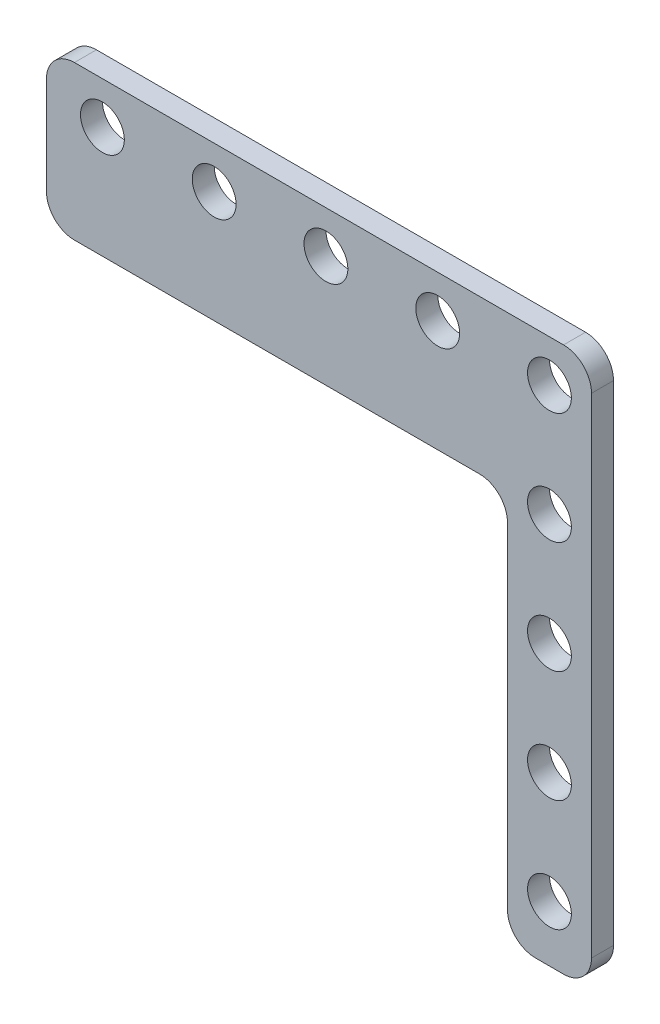
ISO-10303-21;
HEADER;
FILE_DESCRIPTION(('STEP AP214'),'2;1');
FILE_NAME('part.step','',(''),(''),'','','');
FILE_SCHEMA(('AUTOMOTIVE_DESIGN { 1 0 10303 214 1 1 1 1 }'));
ENDSEC;
DATA;
#1=APPLICATION_CONTEXT('core data for automotive mechanical design processes');
#2=APPLICATION_PROTOCOL_DEFINITION('international standard','automotive_design',2000,#1);
#3=PRODUCT_CONTEXT('',#1,'mechanical');
#4=PRODUCT('Part','Part','',(#3));
#5=PRODUCT_RELATED_PRODUCT_CATEGORY('part','',(#4));
#6=PRODUCT_DEFINITION_FORMATION('','',#4);
#7=PRODUCT_DEFINITION_CONTEXT('part definition',#1,'design');
#8=PRODUCT_DEFINITION('design','',#6,#7);
#9=PRODUCT_DEFINITION_SHAPE('','',#8);
#10=(LENGTH_UNIT() NAMED_UNIT(*) SI_UNIT(.MILLI.,.METRE.));
#11=(NAMED_UNIT(*) PLANE_ANGLE_UNIT() SI_UNIT($,.RADIAN.));
#12=(NAMED_UNIT(*) SI_UNIT($,.STERADIAN.) SOLID_ANGLE_UNIT());
#13=UNCERTAINTY_MEASURE_WITH_UNIT(LENGTH_MEASURE(1.E-05),#10,'distance_accuracy_value','');
#14=(GEOMETRIC_REPRESENTATION_CONTEXT(3) GLOBAL_UNCERTAINTY_ASSIGNED_CONTEXT((#13)) GLOBAL_UNIT_ASSIGNED_CONTEXT((#10,
#11,#12)) REPRESENTATION_CONTEXT('',''));
#15=CARTESIAN_POINT('',(0.,0.,0.));
#16=DIRECTION('',(0.,0.,1.));
#17=DIRECTION('',(1.,0.,0.));
#18=AXIS2_PLACEMENT_3D('',#15,#16,#17);
#19=CARTESIAN_POINT('',(17.4752000000032,906.475199999967,1.53492743580445E-13));
#20=DIRECTION('',(0.,1.,0.));
#21=DIRECTION('',(1.,0.,0.));
#22=AXIS2_PLACEMENT_3D('',#19,#20,#21);
#23=PLANE('',#22);
#24=DIRECTION('',(0.,0.,-1.));
#25=VECTOR('',#24,1.);
#26=CARTESIAN_POINT('',(-41.2749999999967,906.475199999967,1.5349987714556E-13));
#27=LINE('',#26,#25);
#28=CARTESIAN_POINT('',(-41.2749999999967,906.475199999967,2.50000000000015));
#29=VERTEX_POINT('',#28);
#30=CARTESIAN_POINT('',(-41.2749999999967,906.475199999967,1.53506279213021E-13));
#31=VERTEX_POINT('',#30);
#32=EDGE_CURVE('E261',#29,#31,#27,.T.);
#33=ORIENTED_EDGE('',*,*,#32,.F.);
#34=DIRECTION('',(-1.,0.,0.));
#35=VECTOR('',#34,1.);
#36=CARTESIAN_POINT('',(17.4752000000032,906.475199999967,2.50000000000015));
#37=LINE('',#36,#35);
#38=CARTESIAN_POINT('',(14.3002000000032,906.475199999967,2.50000000000015));
#39=VERTEX_POINT('',#38);
#40=EDGE_CURVE('E395',#39,#29,#37,.T.);
#41=ORIENTED_EDGE('',*,*,#40,.F.);
#42=DIRECTION('',(0.,0.,1.));
#43=VECTOR('',#42,1.);
#44=CARTESIAN_POINT('',(14.3002000000032,906.475199999967,1.53103754470967E-13));
#45=LINE('',#44,#43);
#46=CARTESIAN_POINT('',(14.3002000000032,906.475199999967,1.53493475078099E-13));
#47=VERTEX_POINT('',#46);
#48=EDGE_CURVE('E11',#47,#39,#45,.T.);
#49=ORIENTED_EDGE('',*,*,#48,.F.);
#50=DIRECTION('',(-1.,0.,0.));
#51=VECTOR('',#50,1.);
#52=CARTESIAN_POINT('',(17.4752000000032,906.475199999967,1.53492743580445E-13));
#53=LINE('',#52,#51);
#54=EDGE_CURVE('E243',#47,#31,#53,.T.);
#55=ORIENTED_EDGE('',*,*,#54,.T.);
#56=EDGE_LOOP('',(#33,#41,#49,#55));
#57=FACE_BOUND('',#56,.T.);
#58=ADVANCED_FACE('F17',(#57),#23,.T.);
#59=CARTESIAN_POINT('',(17.4752000000032,844.549999999967,1.52714765361489E-13));
#60=DIRECTION('',(1.,0.,0.));
#61=DIRECTION('',(0.,1.,0.));
#62=AXIS2_PLACEMENT_3D('',#59,#60,#61);
#63=PLANE('',#62);
#64=DIRECTION('',(0.,0.,1.));
#65=VECTOR('',#64,1.);
#66=CARTESIAN_POINT('',(17.4752000000032,847.724999999967,1.52716778443031E-13));
#67=LINE('',#66,#65);
#68=CARTESIAN_POINT('',(17.4752000000032,847.724999999967,1.52754653498228E-13));
#69=VERTEX_POINT('',#68);
#70=CARTESIAN_POINT('',(17.4752000000032,847.724999999967,2.50000000000015));
#71=VERTEX_POINT('',#70);
#72=EDGE_CURVE('E264',#69,#71,#67,.T.);
#73=ORIENTED_EDGE('',*,*,#72,.F.);
#74=DIRECTION('',(0.,1.,0.));
#75=VECTOR('',#74,1.);
#76=CARTESIAN_POINT('',(17.4752000000032,844.549999999967,1.52714765361489E-13));
#77=LINE('',#76,#75);
#78=CARTESIAN_POINT('',(17.4752000000032,903.300199999967,1.53452855443706E-13));
#79=VERTEX_POINT('',#78);
#80=EDGE_CURVE('E354',#69,#79,#77,.T.);
#81=ORIENTED_EDGE('',*,*,#80,.T.);
#82=DIRECTION('',(0.,0.,-1.));
#83=VECTOR('',#82,1.);
#84=CARTESIAN_POINT('',(17.4752000000032,903.300199999967,1.53103754470967E-13));
#85=LINE('',#84,#83);
#86=CARTESIAN_POINT('',(17.4752000000032,903.300199999967,2.50000000000015));
#87=VERTEX_POINT('',#86);
#88=EDGE_CURVE('E26',#87,#79,#85,.T.);
#89=ORIENTED_EDGE('',*,*,#88,.F.);
#90=DIRECTION('',(0.,1.,0.));
#91=VECTOR('',#90,1.);
#92=CARTESIAN_POINT('',(17.4752000000032,844.549999999967,2.50000000000015));
#93=LINE('',#92,#91);
#94=EDGE_CURVE('E387',#71,#87,#93,.T.);
#95=ORIENTED_EDGE('',*,*,#94,.F.);
#96=EDGE_LOOP('',(#73,#81,#89,#95));
#97=FACE_BOUND('',#96,.T.);
#98=ADVANCED_FACE('F469',(#97),#63,.T.);
#99=CARTESIAN_POINT('',(14.3002000000032,903.300199999967,1.53103754470967E-13));
#100=DIRECTION('',(0.,0.,1.));
#101=DIRECTION('',(0.707106781186552,0.707106781186543,0.));
#102=AXIS2_PLACEMENT_3D('',#99,#100,#101);
#103=CYLINDRICAL_SURFACE('',#102,3.175);
#104=CARTESIAN_POINT('',(14.3002000000032,903.300199999967,2.50000000000015));
#105=DIRECTION('',(0.,0.,-1.));
#106=DIRECTION('',(0.707106781186552,0.707106781186543,0.));
#107=AXIS2_PLACEMENT_3D('',#104,#105,#106);
#108=CIRCLE('',#107,3.175);
#109=EDGE_CURVE('E391',#39,#87,#108,.T.);
#110=ORIENTED_EDGE('',*,*,#109,.T.);
#111=ORIENTED_EDGE('',*,*,#88,.T.);
#112=CARTESIAN_POINT('',(14.3002000000032,903.300199999967,1.53110888036082E-13));
#113=DIRECTION('',(0.,0.,1.));
#114=DIRECTION('',(0.707106781186552,0.707106781186543,0.));
#115=AXIS2_PLACEMENT_3D('',#112,#113,#114);
#116=CIRCLE('',#115,3.175);
#117=EDGE_CURVE('E247',#79,#47,#116,.T.);
#118=ORIENTED_EDGE('',*,*,#117,.T.);
#119=ORIENTED_EDGE('',*,*,#48,.T.);
#120=EDGE_LOOP('',(#110,#111,#118,#119));
#121=FACE_BOUND('',#120,.T.);
#122=ADVANCED_FACE('F474',(#121),#103,.T.);
#123=CARTESIAN_POINT('',(-41.2749999999967,903.300199999967,1.5349987714556E-13));
#124=DIRECTION('',(0.,0.,1.));
#125=DIRECTION('',(-0.707106781186552,0.707106781186543,0.));
#126=AXIS2_PLACEMENT_3D('',#123,#124,#125);
#127=CYLINDRICAL_SURFACE('',#126,3.175);
#128=CARTESIAN_POINT('',(-41.2749999999967,903.300199999967,2.50000000000015));
#129=DIRECTION('',(0.,0.,-1.));
#130=DIRECTION('',(-0.707106781186552,0.707106781186543,0.));
#131=AXIS2_PLACEMENT_3D('',#128,#129,#130);
#132=CIRCLE('',#131,3.175);
#133=CARTESIAN_POINT('',(-44.4499999999967,903.300199999967,2.50000000000015));
#134=VERTEX_POINT('',#133);
#135=EDGE_CURVE('E399',#134,#29,#132,.T.);
#136=ORIENTED_EDGE('',*,*,#135,.T.);
#137=ORIENTED_EDGE('',*,*,#32,.T.);
#138=CARTESIAN_POINT('',(-41.2749999999967,903.300199999967,1.53110888036082E-13));
#139=DIRECTION('',(0.,0.,1.));
#140=DIRECTION('',(-0.707106781186552,0.707106781186543,0.));
#141=AXIS2_PLACEMENT_3D('',#138,#139,#140);
#142=CIRCLE('',#141,3.175);
#143=CARTESIAN_POINT('',(-44.4499999999967,903.300199999967,1.53467122573935E-13));
#144=VERTEX_POINT('',#143);
#145=EDGE_CURVE('E248',#31,#144,#142,.T.);
#146=ORIENTED_EDGE('',*,*,#145,.T.);
#147=DIRECTION('',(0.,0.,1.));
#148=VECTOR('',#147,1.);
#149=CARTESIAN_POINT('',(-44.4499999999967,903.300199999967,1.5349987714556E-13));
#150=LINE('',#149,#148);
#151=EDGE_CURVE('E20',#144,#134,#150,.T.);
#152=ORIENTED_EDGE('',*,*,#151,.T.);
#153=EDGE_LOOP('',(#136,#137,#146,#152));
#154=FACE_BOUND('',#153,.T.);
#155=ADVANCED_FACE('F479',(#154),#127,.T.);
#156=CARTESIAN_POINT('',(-44.4499999999967,906.475199999967,1.53507010710674E-13));
#157=DIRECTION('',(-1.,0.,0.));
#158=DIRECTION('',(0.,0.,1.));
#159=AXIS2_PLACEMENT_3D('',#156,#157,#158);
#160=PLANE('',#159);
#161=DIRECTION('',(0.,0.,-1.));
#162=VECTOR('',#161,1.);
#163=CARTESIAN_POINT('',(-44.4499999999967,892.174999999967,1.53397238558369E-13));
#164=LINE('',#163,#162);
#165=CARTESIAN_POINT('',(-44.4499999999967,892.174999999967,2.50000000000015));
#166=VERTEX_POINT('',#165);
#167=CARTESIAN_POINT('',(-44.4499999999967,892.174999999967,1.53327354542802E-13));
#168=VERTEX_POINT('',#167);
#169=EDGE_CURVE('E39',#166,#168,#164,.T.);
#170=ORIENTED_EDGE('',*,*,#169,.F.);
#171=DIRECTION('',(0.,-1.,0.));
#172=VECTOR('',#171,1.);
#173=CARTESIAN_POINT('',(-44.4499999999967,906.475199999967,2.50000000000015));
#174=LINE('',#173,#172);
#175=EDGE_CURVE('E402',#134,#166,#174,.T.);
#176=ORIENTED_EDGE('',*,*,#175,.F.);
#177=ORIENTED_EDGE('',*,*,#151,.F.);
#178=DIRECTION('',(0.,-1.,0.));
#179=VECTOR('',#178,1.);
#180=CARTESIAN_POINT('',(-44.4499999999967,906.475199999967,1.53507010710674E-13));
#181=LINE('',#180,#179);
#182=EDGE_CURVE('E294',#144,#168,#181,.T.);
#183=ORIENTED_EDGE('',*,*,#182,.T.);
#184=EDGE_LOOP('',(#170,#176,#177,#183));
#185=FACE_BOUND('',#184,.T.);
#186=ADVANCED_FACE('F480',(#185),#160,.T.);
#187=CARTESIAN_POINT('',(-41.2749999999967,892.174999999967,1.53397238558369E-13));
#188=DIRECTION('',(0.,0.,1.));
#189=DIRECTION('',(-0.707106781186552,-0.707106781186543,0.));
#190=AXIS2_PLACEMENT_3D('',#187,#188,#189);
#191=CYLINDRICAL_SURFACE('',#190,3.175);
#192=CARTESIAN_POINT('',(-41.2749999999967,892.174999999967,2.50000000000015));
#193=DIRECTION('',(0.,0.,-1.));
#194=DIRECTION('',(-0.707106781186552,-0.707106781186543,0.));
#195=AXIS2_PLACEMENT_3D('',#192,#193,#194);
#196=CIRCLE('',#195,3.175);
#197=CARTESIAN_POINT('',(-41.2749999999967,888.999999999967,2.50000000000015));
#198=VERTEX_POINT('',#197);
#199=EDGE_CURVE('E405',#198,#166,#196,.T.);
#200=ORIENTED_EDGE('',*,*,#199,.T.);
#201=ORIENTED_EDGE('',*,*,#169,.T.);
#202=CARTESIAN_POINT('',(-41.2749999999967,892.174999999967,1.53110888036082E-13));
#203=DIRECTION('',(0.,0.,1.));
#204=DIRECTION('',(-0.707106781186552,-0.707106781186543,0.));
#205=AXIS2_PLACEMENT_3D('',#202,#203,#204);
#206=CIRCLE('',#205,3.175);
#207=CARTESIAN_POINT('',(-41.2749999999967,888.999999999967,1.5328673490841E-13));
#208=VERTEX_POINT('',#207);
#209=EDGE_CURVE('E290',#168,#208,#206,.T.);
#210=ORIENTED_EDGE('',*,*,#209,.T.);
#211=DIRECTION('',(0.,0.,1.));
#212=VECTOR('',#211,1.);
#213=CARTESIAN_POINT('',(-41.2749999999967,888.999999999967,1.53397238558369E-13));
#214=LINE('',#213,#212);
#215=EDGE_CURVE('E373',#208,#198,#214,.T.);
#216=ORIENTED_EDGE('',*,*,#215,.T.);
#217=EDGE_LOOP('',(#200,#201,#210,#216));
#218=FACE_BOUND('',#217,.T.);
#219=ADVANCED_FACE('F487',(#218),#191,.T.);
#220=CARTESIAN_POINT('',(14.3002000000032,847.724999999967,1.52716778443031E-13));
#221=DIRECTION('',(0.,0.,1.));
#222=DIRECTION('',(0.707106781186552,-0.707106781186543,0.));
#223=AXIS2_PLACEMENT_3D('',#220,#221,#222);
#224=CYLINDRICAL_SURFACE('',#223,3.175);
#225=CARTESIAN_POINT('',(14.3002000000032,847.724999999967,2.50000000000015));
#226=DIRECTION('',(0.,0.,-1.));
#227=DIRECTION('',(0.707106781186552,-0.707106781186543,0.));
#228=AXIS2_PLACEMENT_3D('',#225,#226,#227);
#229=CIRCLE('',#228,3.175);
#230=CARTESIAN_POINT('',(14.3002000000032,844.549999999967,2.50000000000015));
#231=VERTEX_POINT('',#230);
#232=EDGE_CURVE('E383',#71,#231,#229,.T.);
#233=ORIENTED_EDGE('',*,*,#232,.T.);
#234=DIRECTION('',(0.,0.,-1.));
#235=VECTOR('',#234,1.);
#236=CARTESIAN_POINT('',(14.3002000000032,844.549999999967,1.52716778443031E-13));
#237=LINE('',#236,#235);
#238=CARTESIAN_POINT('',(14.3002000000032,844.549999999967,1.52715496859142E-13));
#239=VERTEX_POINT('',#238);
#240=EDGE_CURVE('E349',#231,#239,#237,.T.);
#241=ORIENTED_EDGE('',*,*,#240,.T.);
#242=CARTESIAN_POINT('',(14.3002000000032,847.724999999967,1.53110888036082E-13));
#243=DIRECTION('',(0.,0.,1.));
#244=DIRECTION('',(0.707106781186552,-0.707106781186543,0.));
#245=AXIS2_PLACEMENT_3D('',#242,#243,#244);
#246=CIRCLE('',#245,3.175);
#247=EDGE_CURVE('E358',#239,#69,#246,.T.);
#248=ORIENTED_EDGE('',*,*,#247,.T.);
#249=ORIENTED_EDGE('',*,*,#72,.T.);
#250=EDGE_LOOP('',(#233,#241,#248,#249));
#251=FACE_BOUND('',#250,.T.);
#252=ADVANCED_FACE('F465',(#251),#224,.T.);
#253=CARTESIAN_POINT('',(3.0975222387042E-12,844.549999999967,1.52718791524573E-13));
#254=DIRECTION('',(0.,-1.,0.));
#255=DIRECTION('',(0.,0.,-1.));
#256=AXIS2_PLACEMENT_3D('',#253,#254,#255);
#257=PLANE('',#256);
#258=DIRECTION('',(0.,0.,1.));
#259=VECTOR('',#258,1.);
#260=CARTESIAN_POINT('',(11.0998000000031,844.549999999967,1.25000000000015));
#261=LINE('',#260,#259);
#262=CARTESIAN_POINT('',(11.0998000000031,844.549999999967,1.52716234208777E-13));
#263=VERTEX_POINT('',#262);
#264=CARTESIAN_POINT('',(11.0998000000031,844.549999999967,2.50000000000015));
#265=VERTEX_POINT('',#264);
#266=EDGE_CURVE('E324',#263,#265,#261,.T.);
#267=ORIENTED_EDGE('',*,*,#266,.F.);
#268=DIRECTION('',(1.,0.,0.));
#269=VECTOR('',#268,1.);
#270=CARTESIAN_POINT('',(3.0975222387042E-12,844.549999999967,1.52718791524573E-13));
#271=LINE('',#270,#269);
#272=EDGE_CURVE('E365',#263,#239,#271,.T.);
#273=ORIENTED_EDGE('',*,*,#272,.T.);
#274=ORIENTED_EDGE('',*,*,#240,.F.);
#275=DIRECTION('',(1.,0.,0.));
#276=VECTOR('',#275,1.);
#277=CARTESIAN_POINT('',(3.0975222387042E-12,844.549999999967,2.50000000000015));
#278=LINE('',#277,#276);
#279=EDGE_CURVE('E377',#265,#231,#278,.T.);
#280=ORIENTED_EDGE('',*,*,#279,.F.);
#281=EDGE_LOOP('',(#267,#273,#274,#280));
#282=FACE_BOUND('',#281,.T.);
#283=ADVANCED_FACE('F463',(#282),#257,.T.);
#284=CARTESIAN_POINT('',(-13.4873999999968,875.512599999967,2.50000000000015));
#285=DIRECTION('',(0.,0.,1.));
#286=DIRECTION('',(1.,0.,0.));
#287=AXIS2_PLACEMENT_3D('',#284,#285,#286);
#288=PLANE('',#287);
#289=CARTESIAN_POINT('',(-38.0999999999977,901.699999999967,2.50000000000015));
#290=DIRECTION('',(0.,0.,-1.));
#291=DIRECTION('',(1.,0.,0.));
#292=AXIS2_PLACEMENT_3D('',#289,#290,#291);
#293=CIRCLE('',#292,2.4892);
#294=CARTESIAN_POINT('',(-40.5891999999977,901.699999999967,2.50000000000015));
#295=VERTEX_POINT('',#294);
#296=EDGE_CURVE('E312',#295,#295,#293,.T.);
#297=ORIENTED_EDGE('',*,*,#296,.T.);
#298=EDGE_LOOP('',(#297));
#299=FACE_BOUND('',#298,.T.);
#300=CARTESIAN_POINT('',(12.7000000000032,901.699999999967,2.50000000000015));
#301=DIRECTION('',(0.,0.,-1.));
#302=DIRECTION('',(1.,0.,0.));
#303=AXIS2_PLACEMENT_3D('',#300,#301,#302);
#304=CIRCLE('',#303,2.4892);
#305=CARTESIAN_POINT('',(10.2108000000032,901.699999999967,2.50000000000015));
#306=VERTEX_POINT('',#305);
#307=EDGE_CURVE('E301',#306,#306,#304,.T.);
#308=ORIENTED_EDGE('',*,*,#307,.T.);
#309=EDGE_LOOP('',(#308));
#310=FACE_BOUND('',#309,.T.);
#311=CARTESIAN_POINT('',(12.700000000003,850.89999999997,2.50000000000015));
#312=DIRECTION('',(0.,0.,-1.));
#313=DIRECTION('',(1.,0.,0.));
#314=AXIS2_PLACEMENT_3D('',#311,#312,#313);
#315=CIRCLE('',#314,2.4892);
#316=CARTESIAN_POINT('',(10.210800000003,850.89999999997,2.50000000000015));
#317=VERTEX_POINT('',#316);
#318=EDGE_CURVE('E270',#317,#317,#315,.T.);
#319=ORIENTED_EDGE('',*,*,#318,.T.);
#320=EDGE_LOOP('',(#319));
#321=FACE_BOUND('',#320,.T.);
#322=CARTESIAN_POINT('',(12.7000000000032,888.999999999967,2.50000000000015));
#323=DIRECTION('',(0.,0.,-1.));
#324=DIRECTION('',(1.,0.,0.));
#325=AXIS2_PLACEMENT_3D('',#322,#323,#324);
#326=CIRCLE('',#325,2.4892);
#327=CARTESIAN_POINT('',(10.2108000000032,888.999999999967,2.50000000000015));
#328=VERTEX_POINT('',#327);
#329=EDGE_CURVE('E276',#328,#328,#326,.T.);
#330=ORIENTED_EDGE('',*,*,#329,.T.);
#331=EDGE_LOOP('',(#330));
#332=FACE_BOUND('',#331,.T.);
#333=CARTESIAN_POINT('',(-25.3999999999976,901.699999999967,2.50000000000015));
#334=DIRECTION('',(0.,0.,-1.));
#335=DIRECTION('',(1.,0.,0.));
#336=AXIS2_PLACEMENT_3D('',#333,#334,#335);
#337=CIRCLE('',#336,2.4892);
#338=CARTESIAN_POINT('',(-27.8891999999977,901.699999999967,2.50000000000015));
#339=VERTEX_POINT('',#338);
#340=EDGE_CURVE('E214',#339,#339,#337,.T.);
#341=ORIENTED_EDGE('',*,*,#340,.T.);
#342=EDGE_LOOP('',(#341));
#343=FACE_BOUND('',#342,.T.);
#344=CARTESIAN_POINT('',(3.29514193708748E-12,901.699999999967,2.50000000000015));
#345=DIRECTION('',(0.,0.,-1.));
#346=DIRECTION('',(1.,0.,0.));
#347=AXIS2_PLACEMENT_3D('',#344,#345,#346);
#348=CIRCLE('',#347,2.4892);
#349=CARTESIAN_POINT('',(-2.4891999999967,901.699999999967,2.50000000000015));
#350=VERTEX_POINT('',#349);
#351=EDGE_CURVE('E225',#350,#350,#348,.T.);
#352=ORIENTED_EDGE('',*,*,#351,.T.);
#353=EDGE_LOOP('',(#352));
#354=FACE_BOUND('',#353,.T.);
#355=CARTESIAN_POINT('',(12.7000000000031,863.59999999997,2.50000000000015));
#356=DIRECTION('',(0.,0.,-1.));
#357=DIRECTION('',(1.,0.,0.));
#358=AXIS2_PLACEMENT_3D('',#355,#356,#357);
#359=CIRCLE('',#358,2.4892);
#360=CARTESIAN_POINT('',(10.2108000000031,863.59999999997,2.50000000000015));
#361=VERTEX_POINT('',#360);
#362=EDGE_CURVE('E234',#361,#361,#359,.T.);
#363=ORIENTED_EDGE('',*,*,#362,.T.);
#364=EDGE_LOOP('',(#363));
#365=FACE_BOUND('',#364,.T.);
#366=CARTESIAN_POINT('',(12.7000000000031,876.299999999969,2.50000000000015));
#367=DIRECTION('',(0.,0.,-1.));
#368=DIRECTION('',(1.,0.,0.));
#369=AXIS2_PLACEMENT_3D('',#366,#367,#368);
#370=CIRCLE('',#369,2.4892);
#371=CARTESIAN_POINT('',(10.2108000000031,876.299999999969,2.50000000000015));
#372=VERTEX_POINT('',#371);
#373=EDGE_CURVE('E238',#372,#372,#370,.T.);
#374=ORIENTED_EDGE('',*,*,#373,.T.);
#375=EDGE_LOOP('',(#374));
#376=FACE_BOUND('',#375,.T.);
#377=CARTESIAN_POINT('',(-12.699999999997,901.699999999967,2.50000000000015));
#378=DIRECTION('',(0.,0.,-1.));
#379=DIRECTION('',(1.,0.,0.));
#380=AXIS2_PLACEMENT_3D('',#377,#378,#379);
#381=CIRCLE('',#380,2.4892);
#382=CARTESIAN_POINT('',(-15.189199999997,901.699999999967,2.50000000000015));
#383=VERTEX_POINT('',#382);
#384=EDGE_CURVE('E420',#383,#383,#381,.T.);
#385=ORIENTED_EDGE('',*,*,#384,.T.);
#386=EDGE_LOOP('',(#385));
#387=FACE_BOUND('',#386,.T.);
#388=CARTESIAN_POINT('',(11.0998000000031,847.724999999967,2.50000000000015));
#389=DIRECTION('',(0.,0.,-1.));
#390=DIRECTION('',(-0.707106781186552,-0.707106781186543,0.));
#391=AXIS2_PLACEMENT_3D('',#388,#389,#390);
#392=CIRCLE('',#391,3.175);
#393=CARTESIAN_POINT('',(7.92480000000315,847.724999999967,2.50000000000015));
#394=VERTEX_POINT('',#393);
#395=EDGE_CURVE('E328',#265,#394,#392,.T.);
#396=ORIENTED_EDGE('',*,*,#395,.F.);
#397=ORIENTED_EDGE('',*,*,#279,.T.);
#398=ORIENTED_EDGE('',*,*,#232,.F.);
#399=ORIENTED_EDGE('',*,*,#94,.T.);
#400=ORIENTED_EDGE('',*,*,#109,.F.);
#401=ORIENTED_EDGE('',*,*,#40,.T.);
#402=ORIENTED_EDGE('',*,*,#135,.F.);
#403=ORIENTED_EDGE('',*,*,#175,.T.);
#404=ORIENTED_EDGE('',*,*,#199,.F.);
#405=DIRECTION('',(1.,0.,0.));
#406=VECTOR('',#405,1.);
#407=CARTESIAN_POINT('',(-6.74369999999683,888.999999999967,2.50000000000015));
#408=LINE('',#407,#406);
#409=CARTESIAN_POINT('',(4.74980000000315,888.999999999967,2.50000000000015));
#410=VERTEX_POINT('',#409);
#411=EDGE_CURVE('E281',#198,#410,#408,.T.);
#412=ORIENTED_EDGE('',*,*,#411,.T.);
#413=CARTESIAN_POINT('',(4.74980000000315,885.824999999967,2.50000000000015));
#414=DIRECTION('',(0.,0.,1.));
#415=DIRECTION('',(0.707106781186554,0.707106781186542,0.));
#416=AXIS2_PLACEMENT_3D('',#413,#414,#415);
#417=CIRCLE('',#416,3.175);
#418=CARTESIAN_POINT('',(7.92480000000315,885.824999999967,2.50000000000015));
#419=VERTEX_POINT('',#418);
#420=EDGE_CURVE('E282',#419,#410,#417,.T.);
#421=ORIENTED_EDGE('',*,*,#420,.F.);
#422=DIRECTION('',(0.,-1.,0.));
#423=VECTOR('',#422,1.);
#424=CARTESIAN_POINT('',(7.92480000000315,882.256299999967,2.50000000000015));
#425=LINE('',#424,#423);
#426=EDGE_CURVE('E366',#419,#394,#425,.T.);
#427=ORIENTED_EDGE('',*,*,#426,.T.);
#428=EDGE_LOOP('',(#396,#397,#398,#399,#400,#401,#402,#403,#404,#412,#421,#427));
#429=FACE_BOUND('',#428,.T.);
#430=ADVANCED_FACE('F435',(#299,#310,#321,#332,#343,#354,#365,#376,#387,#429),#288,.T.);
#431=CARTESIAN_POINT('',(-44.4499999999967,888.999999999967,1.53287466406063E-13));
#432=DIRECTION('',(0.,-1.,0.));
#433=DIRECTION('',(-1.,0.,0.));
#434=AXIS2_PLACEMENT_3D('',#431,#432,#433);
#435=PLANE('',#434);
#436=DIRECTION('',(0.,0.,-1.));
#437=VECTOR('',#436,1.);
#438=CARTESIAN_POINT('',(4.74980000000315,888.999999999967,1.25000000000015));
#439=LINE('',#438,#437);
#440=CARTESIAN_POINT('',(4.74980000000315,888.999999999967,1.53208129376766E-13));
#441=VERTEX_POINT('',#440);
#442=EDGE_CURVE('E278',#410,#441,#439,.T.);
#443=ORIENTED_EDGE('',*,*,#442,.F.);
#444=ORIENTED_EDGE('',*,*,#411,.F.);
#445=ORIENTED_EDGE('',*,*,#215,.F.);
#446=DIRECTION('',(-1.,0.,0.));
#447=VECTOR('',#446,1.);
#448=CARTESIAN_POINT('',(-6.74369999999683,888.999999999967,1.53210777398272E-13));
#449=LINE('',#448,#447);
#450=EDGE_CURVE('E295',#441,#208,#449,.T.);
#451=ORIENTED_EDGE('',*,*,#450,.F.);
#452=EDGE_LOOP('',(#443,#444,#445,#451));
#453=FACE_BOUND('',#452,.T.);
#454=ADVANCED_FACE('F491',(#453),#435,.T.);
#455=CARTESIAN_POINT('',(4.74980000000315,885.824999999967,1.25000000000015));
#456=DIRECTION('',(0.,0.,-1.));
#457=DIRECTION('',(0.707106781186554,0.707106781186542,0.));
#458=AXIS2_PLACEMENT_3D('',#455,#456,#457);
#459=CYLINDRICAL_SURFACE('',#458,3.175);
#460=ORIENTED_EDGE('',*,*,#420,.T.);
#461=ORIENTED_EDGE('',*,*,#442,.T.);
#462=CARTESIAN_POINT('',(4.74980000000315,885.824999999967,1.53071999520194E-13));
#463=DIRECTION('',(0.,0.,-1.));
#464=DIRECTION('',(0.707106781186554,0.707106781186542,0.));
#465=AXIS2_PLACEMENT_3D('',#462,#463,#464);
#466=CIRCLE('',#465,3.175);
#467=CARTESIAN_POINT('',(7.92480000000315,885.824999999967,1.53255611663966E-13));
#468=VERTEX_POINT('',#467);
#469=EDGE_CURVE('E340',#441,#468,#466,.T.);
#470=ORIENTED_EDGE('',*,*,#469,.T.);
#471=DIRECTION('',(0.,0.,1.));
#472=VECTOR('',#471,1.);
#473=CARTESIAN_POINT('',(7.92480000000315,885.824999999967,1.25000000000015));
#474=LINE('',#473,#472);
#475=EDGE_CURVE('E369',#468,#419,#474,.T.);
#476=ORIENTED_EDGE('',*,*,#475,.T.);
#477=EDGE_LOOP('',(#460,#461,#470,#476));
#478=FACE_BOUND('',#477,.T.);
#479=ADVANCED_FACE('F495',(#478),#459,.F.);
#480=CARTESIAN_POINT('',(7.92480000000315,888.999999999967,2.50000000000015));
#481=DIRECTION('',(1.,0.,0.));
#482=DIRECTION('',(0.,1.,0.));
#483=AXIS2_PLACEMENT_3D('',#480,#481,#482);
#484=PLANE('',#483);
#485=DIRECTION('',(0.,0.,-1.));
#486=VECTOR('',#485,1.);
#487=CARTESIAN_POINT('',(7.92480000000315,847.724999999967,1.25000000000015));
#488=LINE('',#487,#486);
#489=CARTESIAN_POINT('',(7.92480000000315,847.724999999967,1.52776954023099E-13));
#490=VERTEX_POINT('',#489);
#491=EDGE_CURVE('E332',#394,#490,#488,.T.);
#492=ORIENTED_EDGE('',*,*,#491,.F.);
#493=ORIENTED_EDGE('',*,*,#426,.F.);
#494=ORIENTED_EDGE('',*,*,#475,.F.);
#495=DIRECTION('',(0.,1.,0.));
#496=VECTOR('',#495,1.);
#497=CARTESIAN_POINT('',(7.92480000000315,882.256299999967,1.53210777398272E-13));
#498=LINE('',#497,#496);
#499=EDGE_CURVE('E336',#490,#468,#498,.T.);
#500=ORIENTED_EDGE('',*,*,#499,.F.);
#501=EDGE_LOOP('',(#492,#493,#494,#500));
#502=FACE_BOUND('',#501,.T.);
#503=ADVANCED_FACE('F444',(#502),#484,.F.);
#504=CARTESIAN_POINT('',(-13.4873999999968,875.512599999967,1.53110888036082E-13));
#505=DIRECTION('',(0.,0.,1.));
#506=DIRECTION('',(0.,-1.,0.));
#507=AXIS2_PLACEMENT_3D('',#504,#505,#506);
#508=PLANE('',#507);
#509=CARTESIAN_POINT('',(-38.0999999999977,901.699999999967,1.53210777398272E-13));
#510=DIRECTION('',(0.,0.,1.));
#511=DIRECTION('',(1.,0.,0.));
#512=AXIS2_PLACEMENT_3D('',#509,#510,#511);
#513=CIRCLE('',#512,2.4892);
#514=CARTESIAN_POINT('',(-40.5891999999977,901.699999999967,1.53210777398272E-13));
#515=VERTEX_POINT('',#514);
#516=EDGE_CURVE('E317',#515,#515,#513,.T.);
#517=ORIENTED_EDGE('',*,*,#516,.T.);
#518=EDGE_LOOP('',(#517));
#519=FACE_BOUND('',#518,.T.);
#520=CARTESIAN_POINT('',(12.7000000000032,901.699999999967,1.53210777398272E-13));
#521=DIRECTION('',(0.,0.,1.));
#522=DIRECTION('',(1.,0.,0.));
#523=AXIS2_PLACEMENT_3D('',#520,#521,#522);
#524=CIRCLE('',#523,2.4892);
#525=CARTESIAN_POINT('',(10.2108000000032,901.699999999967,1.53210777398272E-13));
#526=VERTEX_POINT('',#525);
#527=EDGE_CURVE('E309',#526,#526,#524,.T.);
#528=ORIENTED_EDGE('',*,*,#527,.T.);
#529=EDGE_LOOP('',(#528));
#530=FACE_BOUND('',#529,.T.);
#531=CARTESIAN_POINT('',(12.700000000003,850.89999999997,1.53210777398272E-13));
#532=DIRECTION('',(0.,0.,1.));
#533=DIRECTION('',(1.,0.,0.));
#534=AXIS2_PLACEMENT_3D('',#531,#532,#533);
#535=CIRCLE('',#534,2.4892);
#536=CARTESIAN_POINT('',(10.210800000003,850.89999999997,1.53210777398272E-13));
#537=VERTEX_POINT('',#536);
#538=EDGE_CURVE('E269',#537,#537,#535,.T.);
#539=ORIENTED_EDGE('',*,*,#538,.T.);
#540=EDGE_LOOP('',(#539));
#541=FACE_BOUND('',#540,.T.);
#542=CARTESIAN_POINT('',(12.7000000000032,888.999999999967,1.53210777398272E-13));
#543=DIRECTION('',(0.,0.,1.));
#544=DIRECTION('',(1.,0.,0.));
#545=AXIS2_PLACEMENT_3D('',#542,#543,#544);
#546=CIRCLE('',#545,2.4892);
#547=CARTESIAN_POINT('',(10.2108000000032,888.999999999967,1.53210777398272E-13));
#548=VERTEX_POINT('',#547);
#549=EDGE_CURVE('E287',#548,#548,#546,.T.);
#550=ORIENTED_EDGE('',*,*,#549,.T.);
#551=EDGE_LOOP('',(#550));
#552=FACE_BOUND('',#551,.T.);
#553=CARTESIAN_POINT('',(-25.3999999999976,901.699999999967,1.53210777398272E-13));
#554=DIRECTION('',(0.,0.,1.));
#555=DIRECTION('',(1.,0.,0.));
#556=AXIS2_PLACEMENT_3D('',#553,#554,#555);
#557=CIRCLE('',#556,2.4892);
#558=CARTESIAN_POINT('',(-27.8891999999977,901.699999999967,1.53210777398272E-13));
#559=VERTEX_POINT('',#558);
#560=EDGE_CURVE('E274',#559,#559,#557,.T.);
#561=ORIENTED_EDGE('',*,*,#560,.T.);
#562=EDGE_LOOP('',(#561));
#563=FACE_BOUND('',#562,.T.);
#564=CARTESIAN_POINT('',(3.29514193708748E-12,901.699999999967,1.53210777398272E-13));
#565=DIRECTION('',(0.,0.,1.));
#566=DIRECTION('',(1.,0.,0.));
#567=AXIS2_PLACEMENT_3D('',#564,#565,#566);
#568=CIRCLE('',#567,2.4892);
#569=CARTESIAN_POINT('',(-2.4891999999967,901.699999999967,1.53210777398272E-13));
#570=VERTEX_POINT('',#569);
#571=EDGE_CURVE('E208',#570,#570,#568,.T.);
#572=ORIENTED_EDGE('',*,*,#571,.T.);
#573=EDGE_LOOP('',(#572));
#574=FACE_BOUND('',#573,.T.);
#575=CARTESIAN_POINT('',(12.7000000000031,863.59999999997,1.53210777398272E-13));
#576=DIRECTION('',(0.,0.,1.));
#577=DIRECTION('',(1.,0.,0.));
#578=AXIS2_PLACEMENT_3D('',#575,#576,#577);
#579=CIRCLE('',#578,2.4892);
#580=CARTESIAN_POINT('',(10.2108000000031,863.59999999997,1.53210777398272E-13));
#581=VERTEX_POINT('',#580);
#582=EDGE_CURVE('E229',#581,#581,#579,.T.);
#583=ORIENTED_EDGE('',*,*,#582,.T.);
#584=EDGE_LOOP('',(#583));
#585=FACE_BOUND('',#584,.T.);
#586=CARTESIAN_POINT('',(12.7000000000031,876.299999999969,1.53210777398272E-13));
#587=DIRECTION('',(0.,0.,1.));
#588=DIRECTION('',(1.,0.,0.));
#589=AXIS2_PLACEMENT_3D('',#586,#587,#588);
#590=CIRCLE('',#589,2.4892);
#591=CARTESIAN_POINT('',(10.2108000000031,876.299999999969,1.53210777398272E-13));
#592=VERTEX_POINT('',#591);
#593=EDGE_CURVE('E255',#592,#592,#590,.T.);
#594=ORIENTED_EDGE('',*,*,#593,.T.);
#595=EDGE_LOOP('',(#594));
#596=FACE_BOUND('',#595,.T.);
#597=CARTESIAN_POINT('',(-12.699999999997,901.699999999967,1.53210777398272E-13));
#598=DIRECTION('',(0.,0.,1.));
#599=DIRECTION('',(1.,0.,0.));
#600=AXIS2_PLACEMENT_3D('',#597,#598,#599);
#601=CIRCLE('',#600,2.4892);
#602=CARTESIAN_POINT('',(-15.189199999997,901.699999999967,1.53210777398272E-13));
#603=VERTEX_POINT('',#602);
#604=EDGE_CURVE('E235',#603,#603,#601,.T.);
#605=ORIENTED_EDGE('',*,*,#604,.T.);
#606=EDGE_LOOP('',(#605));
#607=FACE_BOUND('',#606,.T.);
#608=CARTESIAN_POINT('',(11.0998000000031,847.724999999967,1.53071999520194E-13));
#609=DIRECTION('',(0.,0.,1.));
#610=DIRECTION('',(-0.707106781186552,-0.707106781186543,0.));
#611=AXIS2_PLACEMENT_3D('',#608,#609,#610);
#612=CIRCLE('',#611,3.175);
#613=EDGE_CURVE('E323',#490,#263,#612,.T.);
#614=ORIENTED_EDGE('',*,*,#613,.F.);
#615=ORIENTED_EDGE('',*,*,#499,.T.);
#616=ORIENTED_EDGE('',*,*,#469,.F.);
#617=ORIENTED_EDGE('',*,*,#450,.T.);
#618=ORIENTED_EDGE('',*,*,#209,.F.);
#619=ORIENTED_EDGE('',*,*,#182,.F.);
#620=ORIENTED_EDGE('',*,*,#145,.F.);
#621=ORIENTED_EDGE('',*,*,#54,.F.);
#622=ORIENTED_EDGE('',*,*,#117,.F.);
#623=ORIENTED_EDGE('',*,*,#80,.F.);
#624=ORIENTED_EDGE('',*,*,#247,.F.);
#625=ORIENTED_EDGE('',*,*,#272,.F.);
#626=EDGE_LOOP('',(#614,#615,#616,#617,#618,#619,#620,#621,#622,#623,#624,#625));
#627=FACE_BOUND('',#626,.T.);
#628=ADVANCED_FACE('F209',(#519,#530,#541,#552,#563,#574,#585,#596,#607,#627),#508,.F.);
#629=CARTESIAN_POINT('',(11.0998000000031,847.724999999967,1.25000000000015));
#630=DIRECTION('',(0.,0.,-1.));
#631=DIRECTION('',(-0.707106781186552,-0.707106781186543,0.));
#632=AXIS2_PLACEMENT_3D('',#629,#630,#631);
#633=CYLINDRICAL_SURFACE('',#632,3.175);
#634=ORIENTED_EDGE('',*,*,#613,.T.);
#635=ORIENTED_EDGE('',*,*,#266,.T.);
#636=ORIENTED_EDGE('',*,*,#395,.T.);
#637=ORIENTED_EDGE('',*,*,#491,.T.);
#638=EDGE_LOOP('',(#634,#635,#636,#637));
#639=FACE_BOUND('',#638,.T.);
#640=ADVANCED_FACE('F443',(#639),#633,.T.);
#641=CARTESIAN_POINT('',(-38.0999999999977,901.699999999967,2.50000000000015));
#642=DIRECTION('',(0.,0.,-1.));
#643=DIRECTION('',(1.,0.,0.));
#644=AXIS2_PLACEMENT_3D('',#641,#642,#643);
#645=CYLINDRICAL_SURFACE('',#644,2.4892);
#646=ORIENTED_EDGE('',*,*,#296,.F.);
#647=DIRECTION('',(0.,0.,-1.));
#648=VECTOR('',#647,1.);
#649=CARTESIAN_POINT('',(-40.5891999999977,901.699999999967,2.50000000000015));
#650=LINE('',#649,#648);
#651=EDGE_CURVE('E313',#295,#515,#650,.T.);
#652=ORIENTED_EDGE('',*,*,#651,.T.);
#653=ORIENTED_EDGE('',*,*,#516,.F.);
#654=ORIENTED_EDGE('',*,*,#651,.F.);
#655=EDGE_LOOP('',(#646,#652,#653,#654));
#656=FACE_BOUND('',#655,.T.);
#657=ADVANCED_FACE('F499',(#656),#645,.F.);
#658=CARTESIAN_POINT('',(12.7000000000032,901.699999999967,2.50000000000015));
#659=DIRECTION('',(0.,0.,-1.));
#660=DIRECTION('',(1.,0.,0.));
#661=AXIS2_PLACEMENT_3D('',#658,#659,#660);
#662=CYLINDRICAL_SURFACE('',#661,2.4892);
#663=ORIENTED_EDGE('',*,*,#307,.F.);
#664=DIRECTION('',(0.,0.,-1.));
#665=VECTOR('',#664,1.);
#666=CARTESIAN_POINT('',(10.2108000000032,901.699999999967,2.50000000000015));
#667=LINE('',#666,#665);
#668=EDGE_CURVE('E305',#306,#526,#667,.T.);
#669=ORIENTED_EDGE('',*,*,#668,.T.);
#670=ORIENTED_EDGE('',*,*,#527,.F.);
#671=ORIENTED_EDGE('',*,*,#668,.F.);
#672=EDGE_LOOP('',(#663,#669,#670,#671));
#673=FACE_BOUND('',#672,.T.);
#674=ADVANCED_FACE('F506',(#673),#662,.F.);
#675=CARTESIAN_POINT('',(12.700000000003,850.89999999997,2.50000000000015));
#676=DIRECTION('',(0.,0.,-1.));
#677=DIRECTION('',(1.,0.,0.));
#678=AXIS2_PLACEMENT_3D('',#675,#676,#677);
#679=CYLINDRICAL_SURFACE('',#678,2.4892);
#680=ORIENTED_EDGE('',*,*,#318,.F.);
#681=DIRECTION('',(0.,0.,-1.));
#682=VECTOR('',#681,1.);
#683=CARTESIAN_POINT('',(10.210800000003,850.89999999997,2.50000000000015));
#684=LINE('',#683,#682);
#685=EDGE_CURVE('E265',#317,#537,#684,.T.);
#686=ORIENTED_EDGE('',*,*,#685,.T.);
#687=ORIENTED_EDGE('',*,*,#538,.F.);
#688=ORIENTED_EDGE('',*,*,#685,.F.);
#689=EDGE_LOOP('',(#680,#686,#687,#688));
#690=FACE_BOUND('',#689,.T.);
#691=ADVANCED_FACE('F539',(#690),#679,.F.);
#692=CARTESIAN_POINT('',(12.7000000000032,888.999999999967,2.50000000000015));
#693=DIRECTION('',(0.,0.,-1.));
#694=DIRECTION('',(1.,0.,0.));
#695=AXIS2_PLACEMENT_3D('',#692,#693,#694);
#696=CYLINDRICAL_SURFACE('',#695,2.4892);
#697=ORIENTED_EDGE('',*,*,#329,.F.);
#698=DIRECTION('',(0.,0.,-1.));
#699=VECTOR('',#698,1.);
#700=CARTESIAN_POINT('',(10.2108000000032,888.999999999967,2.50000000000015));
#701=LINE('',#700,#699);
#702=EDGE_CURVE('E283',#328,#548,#701,.T.);
#703=ORIENTED_EDGE('',*,*,#702,.T.);
#704=ORIENTED_EDGE('',*,*,#549,.F.);
#705=ORIENTED_EDGE('',*,*,#702,.F.);
#706=EDGE_LOOP('',(#697,#703,#704,#705));
#707=FACE_BOUND('',#706,.T.);
#708=ADVANCED_FACE('F438',(#707),#696,.F.);
#709=CARTESIAN_POINT('',(-25.3999999999976,901.699999999967,2.50000000000015));
#710=DIRECTION('',(0.,0.,-1.));
#711=DIRECTION('',(1.,0.,0.));
#712=AXIS2_PLACEMENT_3D('',#709,#710,#711);
#713=CYLINDRICAL_SURFACE('',#712,2.4892);
#714=ORIENTED_EDGE('',*,*,#340,.F.);
#715=DIRECTION('',(0.,0.,-1.));
#716=VECTOR('',#715,1.);
#717=CARTESIAN_POINT('',(-27.8891999999977,901.699999999967,2.50000000000015));
#718=LINE('',#717,#716);
#719=EDGE_CURVE('E222',#339,#559,#718,.T.);
#720=ORIENTED_EDGE('',*,*,#719,.T.);
#721=ORIENTED_EDGE('',*,*,#560,.F.);
#722=ORIENTED_EDGE('',*,*,#719,.F.);
#723=EDGE_LOOP('',(#714,#720,#721,#722));
#724=FACE_BOUND('',#723,.T.);
#725=ADVANCED_FACE('F451',(#724),#713,.F.);
#726=CARTESIAN_POINT('',(3.29514193708748E-12,901.699999999967,2.50000000000015));
#727=DIRECTION('',(0.,0.,-1.));
#728=DIRECTION('',(1.,0.,0.));
#729=AXIS2_PLACEMENT_3D('',#726,#727,#728);
#730=CYLINDRICAL_SURFACE('',#729,2.4892);
#731=ORIENTED_EDGE('',*,*,#351,.F.);
#732=DIRECTION('',(0.,0.,-1.));
#733=VECTOR('',#732,1.);
#734=CARTESIAN_POINT('',(-2.4891999999967,901.699999999967,2.50000000000015));
#735=LINE('',#734,#733);
#736=EDGE_CURVE('E215',#350,#570,#735,.T.);
#737=ORIENTED_EDGE('',*,*,#736,.T.);
#738=ORIENTED_EDGE('',*,*,#571,.F.);
#739=ORIENTED_EDGE('',*,*,#736,.F.);
#740=EDGE_LOOP('',(#731,#737,#738,#739));
#741=FACE_BOUND('',#740,.T.);
#742=ADVANCED_FACE('F562',(#741),#730,.F.);
#743=CARTESIAN_POINT('',(12.7000000000031,863.59999999997,2.50000000000015));
#744=DIRECTION('',(0.,0.,-1.));
#745=DIRECTION('',(1.,0.,0.));
#746=AXIS2_PLACEMENT_3D('',#743,#744,#745);
#747=CYLINDRICAL_SURFACE('',#746,2.4892);
#748=ORIENTED_EDGE('',*,*,#362,.F.);
#749=DIRECTION('',(0.,0.,-1.));
#750=VECTOR('',#749,1.);
#751=CARTESIAN_POINT('',(10.2108000000031,863.59999999997,2.50000000000015));
#752=LINE('',#751,#750);
#753=EDGE_CURVE('E231',#361,#581,#752,.T.);
#754=ORIENTED_EDGE('',*,*,#753,.T.);
#755=ORIENTED_EDGE('',*,*,#582,.F.);
#756=ORIENTED_EDGE('',*,*,#753,.F.);
#757=EDGE_LOOP('',(#748,#754,#755,#756));
#758=FACE_BOUND('',#757,.T.);
#759=ADVANCED_FACE('F565',(#758),#747,.F.);
#760=CARTESIAN_POINT('',(12.7000000000031,876.299999999969,2.50000000000015));
#761=DIRECTION('',(0.,0.,-1.));
#762=DIRECTION('',(1.,0.,0.));
#763=AXIS2_PLACEMENT_3D('',#760,#761,#762);
#764=CYLINDRICAL_SURFACE('',#763,2.4892);
#765=ORIENTED_EDGE('',*,*,#373,.F.);
#766=DIRECTION('',(0.,0.,-1.));
#767=VECTOR('',#766,1.);
#768=CARTESIAN_POINT('',(10.2108000000031,876.299999999969,2.50000000000015));
#769=LINE('',#768,#767);
#770=EDGE_CURVE('E252',#372,#592,#769,.T.);
#771=ORIENTED_EDGE('',*,*,#770,.T.);
#772=ORIENTED_EDGE('',*,*,#593,.F.);
#773=ORIENTED_EDGE('',*,*,#770,.F.);
#774=EDGE_LOOP('',(#765,#771,#772,#773));
#775=FACE_BOUND('',#774,.T.);
#776=ADVANCED_FACE('F570',(#775),#764,.F.);
#777=CARTESIAN_POINT('',(-12.699999999997,901.699999999967,2.50000000000015));
#778=DIRECTION('',(0.,0.,-1.));
#779=DIRECTION('',(1.,0.,0.));
#780=AXIS2_PLACEMENT_3D('',#777,#778,#779);
#781=CYLINDRICAL_SURFACE('',#780,2.4892);
#782=ORIENTED_EDGE('',*,*,#384,.F.);
#783=DIRECTION('',(0.,0.,-1.));
#784=VECTOR('',#783,1.);
#785=CARTESIAN_POINT('',(-15.189199999997,901.699999999967,2.50000000000015));
#786=LINE('',#785,#784);
#787=EDGE_CURVE('E239',#383,#603,#786,.T.);
#788=ORIENTED_EDGE('',*,*,#787,.T.);
#789=ORIENTED_EDGE('',*,*,#604,.F.);
#790=ORIENTED_EDGE('',*,*,#787,.F.);
#791=EDGE_LOOP('',(#782,#788,#789,#790));
#792=FACE_BOUND('',#791,.T.);
#793=ADVANCED_FACE('F572',(#792),#781,.F.);
#794=CLOSED_SHELL('',(#58,#98,#122,#155,#186,#219,#252,#283,#430,#454,#479,#503,#628,#640,#657,
#674,#691,#708,#725,#742,#759,#776,#793));
#795=MANIFOLD_SOLID_BREP('B1',#794);
#796=ADVANCED_BREP_SHAPE_REPRESENTATION('',(#18,#795),#14);
#797=SHAPE_DEFINITION_REPRESENTATION(#9,#796);
ENDSEC;
END-ISO-10303-21;
